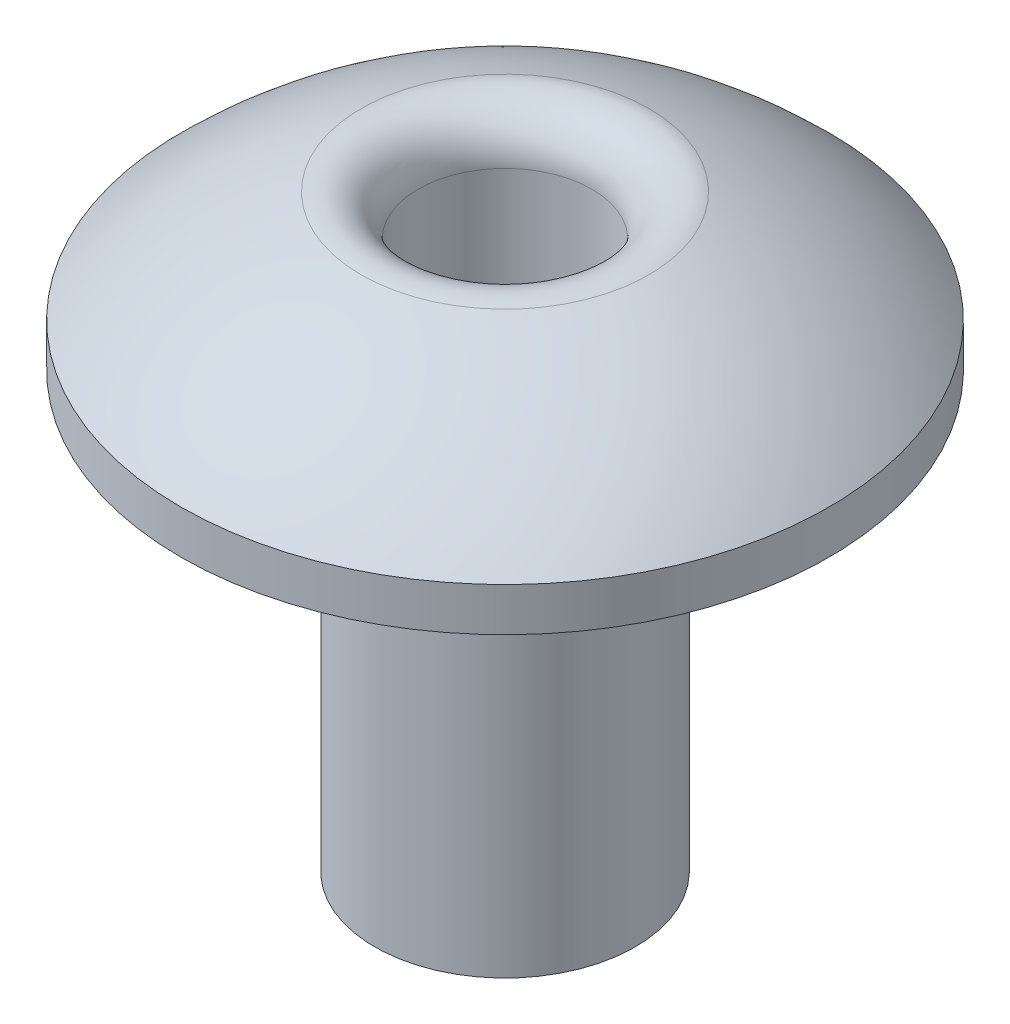
ISO-10303-21;
HEADER;
FILE_DESCRIPTION(('STEP AP214'),'2;1');
FILE_NAME('part.step','',(''),(''),'','','');
FILE_SCHEMA(('AUTOMOTIVE_DESIGN { 1 0 10303 214 1 1 1 1 }'));
ENDSEC;
DATA;
#1=APPLICATION_CONTEXT('core data for automotive mechanical design processes');
#2=APPLICATION_PROTOCOL_DEFINITION('international standard','automotive_design',2000,#1);
#3=PRODUCT_CONTEXT('',#1,'mechanical');
#4=PRODUCT('Part','Part','',(#3));
#5=PRODUCT_RELATED_PRODUCT_CATEGORY('part','',(#4));
#6=PRODUCT_DEFINITION_FORMATION('','',#4);
#7=PRODUCT_DEFINITION_CONTEXT('part definition',#1,'design');
#8=PRODUCT_DEFINITION('design','',#6,#7);
#9=PRODUCT_DEFINITION_SHAPE('','',#8);
#10=(LENGTH_UNIT() NAMED_UNIT(*) SI_UNIT(.MILLI.,.METRE.));
#11=(NAMED_UNIT(*) PLANE_ANGLE_UNIT() SI_UNIT($,.RADIAN.));
#12=(NAMED_UNIT(*) SI_UNIT($,.STERADIAN.) SOLID_ANGLE_UNIT());
#13=UNCERTAINTY_MEASURE_WITH_UNIT(LENGTH_MEASURE(1.E-05),#10,'distance_accuracy_value','');
#14=(GEOMETRIC_REPRESENTATION_CONTEXT(3) GLOBAL_UNCERTAINTY_ASSIGNED_CONTEXT((#13)) GLOBAL_UNIT_ASSIGNED_CONTEXT((#10,
#11,#12)) REPRESENTATION_CONTEXT('',''));
#15=CARTESIAN_POINT('',(0.,0.,0.));
#16=DIRECTION('',(0.,0.,1.));
#17=DIRECTION('',(1.,0.,0.));
#18=AXIS2_PLACEMENT_3D('',#15,#16,#17);
#19=CARTESIAN_POINT('',(0.,-3.73072489628794,0.));
#20=DIRECTION('',(0.,-1.,0.));
#21=DIRECTION('',(0.,0.,1.));
#22=AXIS2_PLACEMENT_3D('',#19,#20,#21);
#23=SPHERICAL_SURFACE('',#22,5.27604174581337);
#24=CARTESIAN_POINT('',(0.,1.27835241179299,0.));
#25=DIRECTION('',(0.,-1.,0.));
#26=DIRECTION('',(0.,0.,-1.));
#27=AXIS2_PLACEMENT_3D('',#24,#25,#26);
#28=CIRCLE('',#27,1.65703380328646);
#29=CARTESIAN_POINT('',(0.,1.27835241179299,-1.65703380328646));
#30=VERTEX_POINT('',#29);
#31=EDGE_CURVE('E37',#30,#30,#28,.T.);
#32=ORIENTED_EDGE('',*,*,#31,.T.);
#33=EDGE_LOOP('',(#32));
#34=FACE_BOUND('',#33,.T.);
#35=CARTESIAN_POINT('',(0.,0.,0.));
#36=DIRECTION('',(0.,-1.,0.));
#37=DIRECTION('',(0.,0.,-1.));
#38=AXIS2_PLACEMENT_3D('',#35,#36,#37);
#39=CIRCLE('',#38,3.73072489628794);
#40=CARTESIAN_POINT('',(0.,0.,-3.73072489628794));
#41=VERTEX_POINT('',#40);
#42=EDGE_CURVE('E50',#41,#41,#39,.T.);
#43=ORIENTED_EDGE('',*,*,#42,.F.);
#44=EDGE_LOOP('',(#43));
#45=FACE_BOUND('',#44,.T.);
#46=ADVANCED_FACE('F30',(#34,#45),#23,.T.);
#47=CARTESIAN_POINT('',(0.,-0.500000000002922,3.73072489628794));
#48=DIRECTION('',(0.,1.,0.));
#49=DIRECTION('',(0.,0.,1.));
#50=AXIS2_PLACEMENT_3D('',#47,#48,#49);
#51=PLANE('',#50);
#52=CARTESIAN_POINT('',(0.,-0.500000000002922,0.));
#53=DIRECTION('',(0.,-1.,0.));
#54=DIRECTION('',(0.,0.,-1.));
#55=AXIS2_PLACEMENT_3D('',#52,#53,#54);
#56=CIRCLE('',#55,1.5);
#57=CARTESIAN_POINT('',(0.,-0.500000000002922,-1.5));
#58=VERTEX_POINT('',#57);
#59=EDGE_CURVE('E41',#58,#58,#56,.T.);
#60=ORIENTED_EDGE('',*,*,#59,.F.);
#61=EDGE_LOOP('',(#60));
#62=FACE_BOUND('',#61,.T.);
#63=CARTESIAN_POINT('',(0.,-0.5,0.));
#64=DIRECTION('',(0.,-1.,0.));
#65=DIRECTION('',(0.,0.,-1.));
#66=AXIS2_PLACEMENT_3D('',#63,#64,#65);
#67=CIRCLE('',#66,3.73072489628794);
#68=CARTESIAN_POINT('',(0.,-0.5,-3.73072489628794));
#69=VERTEX_POINT('',#68);
#70=EDGE_CURVE('E45',#69,#69,#67,.T.);
#71=ORIENTED_EDGE('',*,*,#70,.T.);
#72=EDGE_LOOP('',(#71));
#73=FACE_BOUND('',#72,.T.);
#74=ADVANCED_FACE('F75',(#62,#73),#51,.F.);
#75=CARTESIAN_POINT('',(0.,-0.500000000005845,0.));
#76=DIRECTION('',(0.,-1.,0.));
#77=DIRECTION('',(0.,0.,-1.));
#78=AXIS2_PLACEMENT_3D('',#75,#76,#77);
#79=CYLINDRICAL_SURFACE('',#78,3.73072489628794);
#80=ORIENTED_EDGE('',*,*,#70,.F.);
#81=EDGE_LOOP('',(#80));
#82=FACE_BOUND('',#81,.T.);
#83=ORIENTED_EDGE('',*,*,#42,.T.);
#84=EDGE_LOOP('',(#83));
#85=FACE_BOUND('',#84,.T.);
#86=ADVANCED_FACE('F71',(#82,#85),#79,.T.);
#87=CARTESIAN_POINT('',(0.,-5.50000000000292,0.));
#88=DIRECTION('',(0.,1.,0.));
#89=DIRECTION('',(0.,0.,1.));
#90=AXIS2_PLACEMENT_3D('',#87,#88,#89);
#91=CYLINDRICAL_SURFACE('',#90,1.5);
#92=CARTESIAN_POINT('',(0.,-5.50000000000292,0.));
#93=DIRECTION('',(0.,-1.,0.));
#94=DIRECTION('',(0.,0.,-1.));
#95=AXIS2_PLACEMENT_3D('',#92,#93,#94);
#96=CIRCLE('',#95,1.5);
#97=CARTESIAN_POINT('',(0.,-5.50000000000292,-1.5));
#98=VERTEX_POINT('',#97);
#99=EDGE_CURVE('E52',#98,#98,#96,.T.);
#100=ORIENTED_EDGE('',*,*,#99,.F.);
#101=EDGE_LOOP('',(#100));
#102=FACE_BOUND('',#101,.T.);
#103=ORIENTED_EDGE('',*,*,#59,.T.);
#104=EDGE_LOOP('',(#103));
#105=FACE_BOUND('',#104,.T.);
#106=ADVANCED_FACE('F65',(#102,#105),#91,.T.);
#107=CARTESIAN_POINT('',(0.,-5.50000000000292,0.));
#108=DIRECTION('',(0.,-1.,0.));
#109=DIRECTION('',(0.,0.,-1.));
#110=AXIS2_PLACEMENT_3D('',#107,#108,#109);
#111=PLANE('',#110);
#112=CARTESIAN_POINT('',(0.,-5.50000000000292,0.));
#113=DIRECTION('',(0.,-1.,0.));
#114=DIRECTION('',(0.,0.,-1.));
#115=AXIS2_PLACEMENT_3D('',#112,#113,#114);
#116=CIRCLE('',#115,1.);
#117=CARTESIAN_POINT('',(0.,-5.50000000000292,-1.));
#118=VERTEX_POINT('',#117);
#119=EDGE_CURVE('E56',#118,#118,#116,.T.);
#120=ORIENTED_EDGE('',*,*,#119,.F.);
#121=EDGE_LOOP('',(#120));
#122=FACE_BOUND('',#121,.T.);
#123=ORIENTED_EDGE('',*,*,#99,.T.);
#124=EDGE_LOOP('',(#123));
#125=FACE_BOUND('',#124,.T.);
#126=ADVANCED_FACE('F62',(#122,#125),#111,.T.);
#127=CARTESIAN_POINT('',(0.,1.54531684952542,0.));
#128=DIRECTION('',(0.,-1.,0.));
#129=DIRECTION('',(0.,0.,-1.));
#130=AXIS2_PLACEMENT_3D('',#127,#128,#129);
#131=CYLINDRICAL_SURFACE('',#130,1.);
#132=CARTESIAN_POINT('',(0.,0.80365210146511,0.));
#133=DIRECTION('',(0.,-1.,0.));
#134=DIRECTION('',(0.,0.,-1.));
#135=AXIS2_PLACEMENT_3D('',#132,#133,#134);
#136=CIRCLE('',#135,1.);
#137=CARTESIAN_POINT('',(0.,0.80365210146511,-1.));
#138=VERTEX_POINT('',#137);
#139=EDGE_CURVE('E10',#138,#138,#136,.F.);
#140=ORIENTED_EDGE('',*,*,#139,.T.);
#141=EDGE_LOOP('',(#140));
#142=FACE_BOUND('',#141,.T.);
#143=ORIENTED_EDGE('',*,*,#119,.T.);
#144=EDGE_LOOP('',(#143));
#145=FACE_BOUND('',#144,.T.);
#146=ADVANCED_FACE('F60',(#142,#145),#131,.F.);
#147=CARTESIAN_POINT('',(0.,0.803652101465109,0.));
#148=DIRECTION('',(0.,-1.,0.));
#149=DIRECTION('',(0.,0.,-1.));
#150=AXIS2_PLACEMENT_3D('',#147,#148,#149);
#151=TOROIDAL_SURFACE('',#150,1.5,0.5);
#152=ORIENTED_EDGE('',*,*,#139,.F.);
#153=EDGE_LOOP('',(#152));
#154=FACE_BOUND('',#153,.T.);
#155=ORIENTED_EDGE('',*,*,#31,.F.);
#156=EDGE_LOOP('',(#155));
#157=FACE_BOUND('',#156,.T.);
#158=ADVANCED_FACE('F32',(#154,#157),#151,.T.);
#159=CLOSED_SHELL('',(#46,#74,#86,#106,#126,#146,#158));
#160=MANIFOLD_SOLID_BREP('B2',#159);
#161=ADVANCED_BREP_SHAPE_REPRESENTATION('',(#18,#160),#14);
#162=SHAPE_DEFINITION_REPRESENTATION(#9,#161);
ENDSEC;
END-ISO-10303-21;
